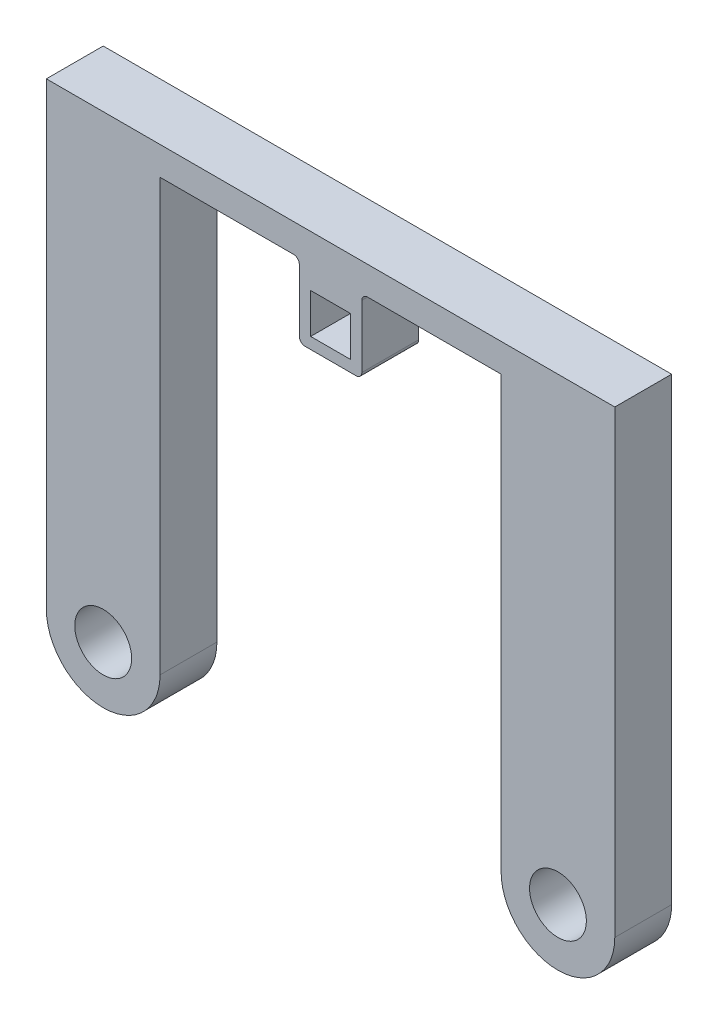
ISO-10303-21;
HEADER;
FILE_DESCRIPTION(('STEP AP214'),'2;1');
FILE_NAME('part.step','',(''),(''),'','','');
FILE_SCHEMA(('AUTOMOTIVE_DESIGN { 1 0 10303 214 1 1 1 1 }'));
ENDSEC;
DATA;
#1=APPLICATION_CONTEXT('core data for automotive mechanical design processes');
#2=APPLICATION_PROTOCOL_DEFINITION('international standard','automotive_design',2000,#1);
#3=PRODUCT_CONTEXT('',#1,'mechanical');
#4=PRODUCT('Part','Part','',(#3));
#5=PRODUCT_RELATED_PRODUCT_CATEGORY('part','',(#4));
#6=PRODUCT_DEFINITION_FORMATION('','',#4);
#7=PRODUCT_DEFINITION_CONTEXT('part definition',#1,'design');
#8=PRODUCT_DEFINITION('design','',#6,#7);
#9=PRODUCT_DEFINITION_SHAPE('','',#8);
#10=(LENGTH_UNIT() NAMED_UNIT(*) SI_UNIT(.MILLI.,.METRE.));
#11=(NAMED_UNIT(*) PLANE_ANGLE_UNIT() SI_UNIT($,.RADIAN.));
#12=(NAMED_UNIT(*) SI_UNIT($,.STERADIAN.) SOLID_ANGLE_UNIT());
#13=UNCERTAINTY_MEASURE_WITH_UNIT(LENGTH_MEASURE(1.E-05),#10,'distance_accuracy_value','');
#14=(GEOMETRIC_REPRESENTATION_CONTEXT(3) GLOBAL_UNCERTAINTY_ASSIGNED_CONTEXT((#13)) GLOBAL_UNIT_ASSIGNED_CONTEXT((#10,
#11,#12)) REPRESENTATION_CONTEXT('',''));
#15=CARTESIAN_POINT('',(0.,0.,0.));
#16=DIRECTION('',(0.,0.,1.));
#17=DIRECTION('',(1.,0.,0.));
#18=AXIS2_PLACEMENT_3D('',#15,#16,#17);
#19=CARTESIAN_POINT('',(0.,75.8172307653194,5.));
#20=DIRECTION('',(0.,1.,0.));
#21=DIRECTION('',(0.,0.,1.));
#22=AXIS2_PLACEMENT_3D('',#19,#20,#21);
#23=PLANE('',#22);
#24=DIRECTION('',(1.,0.,0.));
#25=VECTOR('',#24,1.);
#26=CARTESIAN_POINT('',(0.,75.8172307653194,-5.));
#27=LINE('',#26,#25);
#28=CARTESIAN_POINT('',(-30.,75.8172307653194,-5.));
#29=VERTEX_POINT('',#28);
#30=CARTESIAN_POINT('',(-6.5,75.8172307653194,-5.));
#31=VERTEX_POINT('',#30);
#32=EDGE_CURVE('E269',#29,#31,#27,.T.);
#33=ORIENTED_EDGE('',*,*,#32,.T.);
#34=DIRECTION('',(0.,0.,1.));
#35=VECTOR('',#34,1.);
#36=CARTESIAN_POINT('',(-6.5,75.8172307653194,5.));
#37=LINE('',#36,#35);
#38=CARTESIAN_POINT('',(-6.5,75.8172307653194,5.));
#39=VERTEX_POINT('',#38);
#40=EDGE_CURVE('E305',#31,#39,#37,.T.);
#41=ORIENTED_EDGE('',*,*,#40,.T.);
#42=DIRECTION('',(1.,0.,0.));
#43=VECTOR('',#42,1.);
#44=CARTESIAN_POINT('',(0.,75.8172307653194,5.));
#45=LINE('',#44,#43);
#46=CARTESIAN_POINT('',(-30.,75.8172307653194,5.));
#47=VERTEX_POINT('',#46);
#48=EDGE_CURVE('E237',#47,#39,#45,.T.);
#49=ORIENTED_EDGE('',*,*,#48,.F.);
#50=DIRECTION('',(0.,0.,-1.));
#51=VECTOR('',#50,1.);
#52=CARTESIAN_POINT('',(-30.,75.8172307653194,5.));
#53=LINE('',#52,#51);
#54=EDGE_CURVE('E299',#47,#29,#53,.T.);
#55=ORIENTED_EDGE('',*,*,#54,.T.);
#56=EDGE_LOOP('',(#33,#41,#49,#55));
#57=FACE_BOUND('',#56,.T.);
#58=ADVANCED_FACE('F43',(#57),#23,.F.);
#59=CARTESIAN_POINT('',(-50.,0.,5.));
#60=DIRECTION('',(-1.,0.,0.));
#61=DIRECTION('',(0.,0.,1.));
#62=AXIS2_PLACEMENT_3D('',#59,#60,#61);
#63=PLANE('',#62);
#64=DIRECTION('',(0.,1.,0.));
#65=VECTOR('',#64,1.);
#66=CARTESIAN_POINT('',(-50.,0.,-5.));
#67=LINE('',#66,#65);
#68=CARTESIAN_POINT('',(-50.,0.,-5.));
#69=VERTEX_POINT('',#68);
#70=CARTESIAN_POINT('',(-50.,80.8172307653194,-5.));
#71=VERTEX_POINT('',#70);
#72=EDGE_CURVE('E259',#69,#71,#67,.T.);
#73=ORIENTED_EDGE('',*,*,#72,.F.);
#74=DIRECTION('',(0.,0.,-1.));
#75=VECTOR('',#74,1.);
#76=CARTESIAN_POINT('',(-50.,0.,5.));
#77=LINE('',#76,#75);
#78=CARTESIAN_POINT('',(-50.,0.,5.));
#79=VERTEX_POINT('',#78);
#80=EDGE_CURVE('E303',#79,#69,#77,.T.);
#81=ORIENTED_EDGE('',*,*,#80,.F.);
#82=DIRECTION('',(0.,1.,0.));
#83=VECTOR('',#82,1.);
#84=CARTESIAN_POINT('',(-50.,0.,5.));
#85=LINE('',#84,#83);
#86=CARTESIAN_POINT('',(-50.,80.8172307653194,5.));
#87=VERTEX_POINT('',#86);
#88=EDGE_CURVE('E227',#79,#87,#85,.T.);
#89=ORIENTED_EDGE('',*,*,#88,.T.);
#90=DIRECTION('',(0.,0.,-1.));
#91=VECTOR('',#90,1.);
#92=CARTESIAN_POINT('',(-50.,80.8172307653194,5.));
#93=LINE('',#92,#91);
#94=EDGE_CURVE('E258',#87,#71,#93,.T.);
#95=ORIENTED_EDGE('',*,*,#94,.T.);
#96=EDGE_LOOP('',(#73,#81,#89,#95));
#97=FACE_BOUND('',#96,.T.);
#98=ADVANCED_FACE('F385',(#97),#63,.T.);
#99=CARTESIAN_POINT('',(-40.,0.,5.));
#100=DIRECTION('',(0.,0.,-1.));
#101=DIRECTION('',(-1.,0.,0.));
#102=AXIS2_PLACEMENT_3D('',#99,#100,#101);
#103=CYLINDRICAL_SURFACE('',#102,10.);
#104=CARTESIAN_POINT('',(-40.,0.,-5.));
#105=DIRECTION('',(0.,0.,1.));
#106=DIRECTION('',(1.,0.,0.));
#107=AXIS2_PLACEMENT_3D('',#104,#105,#106);
#108=CIRCLE('',#107,10.);
#109=CARTESIAN_POINT('',(-30.,0.,-5.));
#110=VERTEX_POINT('',#109);
#111=EDGE_CURVE('E262',#69,#110,#108,.T.);
#112=ORIENTED_EDGE('',*,*,#111,.T.);
#113=DIRECTION('',(0.,0.,-1.));
#114=VECTOR('',#113,1.);
#115=CARTESIAN_POINT('',(-30.,0.,5.));
#116=LINE('',#115,#114);
#117=CARTESIAN_POINT('',(-30.,0.,5.));
#118=VERTEX_POINT('',#117);
#119=EDGE_CURVE('E301',#118,#110,#116,.T.);
#120=ORIENTED_EDGE('',*,*,#119,.F.);
#121=CARTESIAN_POINT('',(-40.,0.,5.));
#122=DIRECTION('',(0.,0.,1.));
#123=DIRECTION('',(1.,0.,0.));
#124=AXIS2_PLACEMENT_3D('',#121,#122,#123);
#125=CIRCLE('',#124,10.);
#126=EDGE_CURVE('E230',#79,#118,#125,.T.);
#127=ORIENTED_EDGE('',*,*,#126,.F.);
#128=ORIENTED_EDGE('',*,*,#80,.T.);
#129=EDGE_LOOP('',(#112,#120,#127,#128));
#130=FACE_BOUND('',#129,.T.);
#131=ADVANCED_FACE('F402',(#130),#103,.T.);
#132=CARTESIAN_POINT('',(-30.,0.,5.));
#133=DIRECTION('',(1.,0.,0.));
#134=DIRECTION('',(0.,0.,-1.));
#135=AXIS2_PLACEMENT_3D('',#132,#133,#134);
#136=PLANE('',#135);
#137=DIRECTION('',(0.,-1.,0.));
#138=VECTOR('',#137,1.);
#139=CARTESIAN_POINT('',(-30.,0.,-5.));
#140=LINE('',#139,#138);
#141=EDGE_CURVE('E265',#29,#110,#140,.T.);
#142=ORIENTED_EDGE('',*,*,#141,.F.);
#143=ORIENTED_EDGE('',*,*,#54,.F.);
#144=DIRECTION('',(0.,-1.,0.));
#145=VECTOR('',#144,1.);
#146=CARTESIAN_POINT('',(-30.,0.,5.));
#147=LINE('',#146,#145);
#148=EDGE_CURVE('E233',#47,#118,#147,.T.);
#149=ORIENTED_EDGE('',*,*,#148,.T.);
#150=ORIENTED_EDGE('',*,*,#119,.T.);
#151=EDGE_LOOP('',(#142,#143,#149,#150));
#152=FACE_BOUND('',#151,.T.);
#153=ADVANCED_FACE('F378',(#152),#136,.T.);
#154=CARTESIAN_POINT('',(6.50000000000001,75.8172307653194,5.));
#155=VERTEX_POINT('',#154);
#156=CARTESIAN_POINT('',(30.,75.8172307653194,5.));
#157=VERTEX_POINT('',#156);
#158=EDGE_CURVE('E236',#155,#157,#45,.T.);
#159=ORIENTED_EDGE('',*,*,#158,.F.);
#160=DIRECTION('',(0.,0.,1.));
#161=VECTOR('',#160,1.);
#162=CARTESIAN_POINT('',(6.50000000000001,75.8172307653194,5.));
#163=LINE('',#162,#161);
#164=CARTESIAN_POINT('',(6.50000000000001,75.8172307653194,-5.));
#165=VERTEX_POINT('',#164);
#166=EDGE_CURVE('E318',#155,#165,#163,.F.);
#167=ORIENTED_EDGE('',*,*,#166,.T.);
#168=CARTESIAN_POINT('',(30.,75.8172307653194,-5.));
#169=VERTEX_POINT('',#168);
#170=EDGE_CURVE('E268',#165,#169,#27,.T.);
#171=ORIENTED_EDGE('',*,*,#170,.T.);
#172=DIRECTION('',(0.,0.,-1.));
#173=VECTOR('',#172,1.);
#174=CARTESIAN_POINT('',(30.,75.8172307653194,5.));
#175=LINE('',#174,#173);
#176=EDGE_CURVE('E296',#157,#169,#175,.T.);
#177=ORIENTED_EDGE('',*,*,#176,.F.);
#178=EDGE_LOOP('',(#159,#167,#171,#177));
#179=FACE_BOUND('',#178,.T.);
#180=ADVANCED_FACE('F345',(#179),#23,.F.);
#181=CARTESIAN_POINT('',(30.,0.,5.));
#182=DIRECTION('',(-1.,0.,0.));
#183=DIRECTION('',(0.,0.,1.));
#184=AXIS2_PLACEMENT_3D('',#181,#182,#183);
#185=PLANE('',#184);
#186=DIRECTION('',(0.,1.,0.));
#187=VECTOR('',#186,1.);
#188=CARTESIAN_POINT('',(30.,0.,-5.));
#189=LINE('',#188,#187);
#190=CARTESIAN_POINT('',(30.,0.,-5.));
#191=VERTEX_POINT('',#190);
#192=EDGE_CURVE('E272',#191,#169,#189,.T.);
#193=ORIENTED_EDGE('',*,*,#192,.F.);
#194=DIRECTION('',(0.,0.,-1.));
#195=VECTOR('',#194,1.);
#196=CARTESIAN_POINT('',(30.,0.,5.));
#197=LINE('',#196,#195);
#198=CARTESIAN_POINT('',(30.,0.,5.));
#199=VERTEX_POINT('',#198);
#200=EDGE_CURVE('E294',#199,#191,#197,.T.);
#201=ORIENTED_EDGE('',*,*,#200,.F.);
#202=DIRECTION('',(0.,1.,0.));
#203=VECTOR('',#202,1.);
#204=CARTESIAN_POINT('',(30.,0.,5.));
#205=LINE('',#204,#203);
#206=EDGE_CURVE('E240',#199,#157,#205,.T.);
#207=ORIENTED_EDGE('',*,*,#206,.T.);
#208=ORIENTED_EDGE('',*,*,#176,.T.);
#209=EDGE_LOOP('',(#193,#201,#207,#208));
#210=FACE_BOUND('',#209,.T.);
#211=ADVANCED_FACE('F401',(#210),#185,.T.);
#212=CARTESIAN_POINT('',(40.,0.,5.));
#213=DIRECTION('',(0.,0.,-1.));
#214=DIRECTION('',(-1.,0.,0.));
#215=AXIS2_PLACEMENT_3D('',#212,#213,#214);
#216=CYLINDRICAL_SURFACE('',#215,10.);
#217=CARTESIAN_POINT('',(40.,0.,-5.));
#218=DIRECTION('',(0.,0.,1.));
#219=DIRECTION('',(1.,0.,0.));
#220=AXIS2_PLACEMENT_3D('',#217,#218,#219);
#221=CIRCLE('',#220,10.);
#222=CARTESIAN_POINT('',(50.,0.,-5.));
#223=VERTEX_POINT('',#222);
#224=EDGE_CURVE('E275',#223,#191,#221,.F.);
#225=ORIENTED_EDGE('',*,*,#224,.F.);
#226=DIRECTION('',(0.,0.,-1.));
#227=VECTOR('',#226,1.);
#228=CARTESIAN_POINT('',(50.,0.,5.));
#229=LINE('',#228,#227);
#230=CARTESIAN_POINT('',(50.,0.,5.));
#231=VERTEX_POINT('',#230);
#232=EDGE_CURVE('E292',#231,#223,#229,.T.);
#233=ORIENTED_EDGE('',*,*,#232,.F.);
#234=CARTESIAN_POINT('',(40.,0.,5.));
#235=DIRECTION('',(0.,0.,1.));
#236=DIRECTION('',(1.,0.,0.));
#237=AXIS2_PLACEMENT_3D('',#234,#235,#236);
#238=CIRCLE('',#237,10.);
#239=EDGE_CURVE('E243',#231,#199,#238,.F.);
#240=ORIENTED_EDGE('',*,*,#239,.T.);
#241=ORIENTED_EDGE('',*,*,#200,.T.);
#242=EDGE_LOOP('',(#225,#233,#240,#241));
#243=FACE_BOUND('',#242,.T.);
#244=ADVANCED_FACE('F398',(#243),#216,.T.);
#245=CARTESIAN_POINT('',(50.,0.,5.));
#246=DIRECTION('',(1.,0.,0.));
#247=DIRECTION('',(0.,0.,-1.));
#248=AXIS2_PLACEMENT_3D('',#245,#246,#247);
#249=PLANE('',#248);
#250=DIRECTION('',(0.,-1.,0.));
#251=VECTOR('',#250,1.);
#252=CARTESIAN_POINT('',(50.,0.,-5.));
#253=LINE('',#252,#251);
#254=CARTESIAN_POINT('',(50.,80.8172307653194,-5.));
#255=VERTEX_POINT('',#254);
#256=EDGE_CURVE('E278',#255,#223,#253,.T.);
#257=ORIENTED_EDGE('',*,*,#256,.F.);
#258=DIRECTION('',(0.,0.,-1.));
#259=VECTOR('',#258,1.);
#260=CARTESIAN_POINT('',(50.,80.8172307653194,5.));
#261=LINE('',#260,#259);
#262=CARTESIAN_POINT('',(50.,80.8172307653194,5.));
#263=VERTEX_POINT('',#262);
#264=EDGE_CURVE('E290',#263,#255,#261,.T.);
#265=ORIENTED_EDGE('',*,*,#264,.F.);
#266=DIRECTION('',(0.,-1.,0.));
#267=VECTOR('',#266,1.);
#268=CARTESIAN_POINT('',(50.,0.,5.));
#269=LINE('',#268,#267);
#270=EDGE_CURVE('E246',#263,#231,#269,.T.);
#271=ORIENTED_EDGE('',*,*,#270,.T.);
#272=ORIENTED_EDGE('',*,*,#232,.T.);
#273=EDGE_LOOP('',(#257,#265,#271,#272));
#274=FACE_BOUND('',#273,.T.);
#275=ADVANCED_FACE('F394',(#274),#249,.T.);
#276=CARTESIAN_POINT('',(-40.,0.,5.));
#277=DIRECTION('',(0.,0.,-1.));
#278=DIRECTION('',(-1.,0.,0.));
#279=AXIS2_PLACEMENT_3D('',#276,#277,#278);
#280=CYLINDRICAL_SURFACE('',#279,5.);
#281=CARTESIAN_POINT('',(-40.,0.,5.));
#282=DIRECTION('',(0.,0.,1.));
#283=DIRECTION('',(1.,0.,0.));
#284=AXIS2_PLACEMENT_3D('',#281,#282,#283);
#285=CIRCLE('',#284,5.);
#286=CARTESIAN_POINT('',(-35.,0.,5.));
#287=VERTEX_POINT('',#286);
#288=EDGE_CURVE('E252',#287,#287,#285,.T.);
#289=ORIENTED_EDGE('',*,*,#288,.T.);
#290=EDGE_LOOP('',(#289));
#291=FACE_BOUND('',#290,.T.);
#292=CARTESIAN_POINT('',(-40.,0.,-5.));
#293=DIRECTION('',(0.,0.,1.));
#294=DIRECTION('',(1.,0.,0.));
#295=AXIS2_PLACEMENT_3D('',#292,#293,#294);
#296=CIRCLE('',#295,5.);
#297=CARTESIAN_POINT('',(-35.,0.,-5.));
#298=VERTEX_POINT('',#297);
#299=EDGE_CURVE('E284',#298,#298,#296,.T.);
#300=ORIENTED_EDGE('',*,*,#299,.F.);
#301=EDGE_LOOP('',(#300));
#302=FACE_BOUND('',#301,.T.);
#303=ADVANCED_FACE('F427',(#291,#302),#280,.F.);
#304=CARTESIAN_POINT('',(0.,80.8172307653194,5.));
#305=DIRECTION('',(0.,1.,0.));
#306=DIRECTION('',(0.,0.,1.));
#307=AXIS2_PLACEMENT_3D('',#304,#305,#306);
#308=PLANE('',#307);
#309=DIRECTION('',(1.,0.,0.));
#310=VECTOR('',#309,1.);
#311=CARTESIAN_POINT('',(0.,80.8172307653194,-5.));
#312=LINE('',#311,#310);
#313=EDGE_CURVE('E281',#71,#255,#312,.T.);
#314=ORIENTED_EDGE('',*,*,#313,.F.);
#315=ORIENTED_EDGE('',*,*,#94,.F.);
#316=DIRECTION('',(1.,0.,0.));
#317=VECTOR('',#316,1.);
#318=CARTESIAN_POINT('',(0.,80.8172307653194,5.));
#319=LINE('',#318,#317);
#320=EDGE_CURVE('E249',#87,#263,#319,.T.);
#321=ORIENTED_EDGE('',*,*,#320,.T.);
#322=ORIENTED_EDGE('',*,*,#264,.T.);
#323=EDGE_LOOP('',(#314,#315,#321,#322));
#324=FACE_BOUND('',#323,.T.);
#325=ADVANCED_FACE('F390',(#324),#308,.T.);
#326=CARTESIAN_POINT('',(40.,0.,5.));
#327=DIRECTION('',(0.,0.,-1.));
#328=DIRECTION('',(-1.,0.,0.));
#329=AXIS2_PLACEMENT_3D('',#326,#327,#328);
#330=CYLINDRICAL_SURFACE('',#329,5.);
#331=CARTESIAN_POINT('',(40.,0.,5.));
#332=DIRECTION('',(0.,0.,1.));
#333=DIRECTION('',(1.,0.,0.));
#334=AXIS2_PLACEMENT_3D('',#331,#332,#333);
#335=CIRCLE('',#334,5.);
#336=CARTESIAN_POINT('',(45.,0.,5.));
#337=VERTEX_POINT('',#336);
#338=EDGE_CURVE('E255',#337,#337,#335,.F.);
#339=ORIENTED_EDGE('',*,*,#338,.F.);
#340=EDGE_LOOP('',(#339));
#341=FACE_BOUND('',#340,.T.);
#342=CARTESIAN_POINT('',(40.,0.,-5.));
#343=DIRECTION('',(0.,0.,1.));
#344=DIRECTION('',(1.,0.,0.));
#345=AXIS2_PLACEMENT_3D('',#342,#343,#344);
#346=CIRCLE('',#345,5.);
#347=CARTESIAN_POINT('',(45.,0.,-5.));
#348=VERTEX_POINT('',#347);
#349=EDGE_CURVE('E231',#348,#348,#346,.F.);
#350=ORIENTED_EDGE('',*,*,#349,.T.);
#351=EDGE_LOOP('',(#350));
#352=FACE_BOUND('',#351,.T.);
#353=ADVANCED_FACE('F430',(#341,#352),#330,.F.);
#354=CARTESIAN_POINT('',(0.,0.,5.));
#355=DIRECTION('',(0.,0.,1.));
#356=DIRECTION('',(1.,0.,0.));
#357=AXIS2_PLACEMENT_3D('',#354,#355,#356);
#358=PLANE('',#357);
#359=DIRECTION('',(1.,0.,0.));
#360=VECTOR('',#359,1.);
#361=CARTESIAN_POINT('',(0.,62.8172307653194,5.));
#362=LINE('',#361,#360);
#363=CARTESIAN_POINT('',(-4.5,62.8172307653194,5.));
#364=VERTEX_POINT('',#363);
#365=CARTESIAN_POINT('',(4.50000000000001,62.8172307653194,5.));
#366=VERTEX_POINT('',#365);
#367=EDGE_CURVE('E213',#364,#366,#362,.T.);
#368=ORIENTED_EDGE('',*,*,#367,.T.);
#369=CARTESIAN_POINT('',(4.50000000000001,63.8172307653194,5.));
#370=DIRECTION('',(0.,0.,1.));
#371=DIRECTION('',(1.,0.,0.));
#372=AXIS2_PLACEMENT_3D('',#369,#370,#371);
#373=CIRCLE('',#372,1.);
#374=CARTESIAN_POINT('',(5.50000000000001,63.8172307653194,5.));
#375=VERTEX_POINT('',#374);
#376=EDGE_CURVE('E58',#366,#375,#373,.T.);
#377=ORIENTED_EDGE('',*,*,#376,.T.);
#378=DIRECTION('',(0.,1.,0.));
#379=VECTOR('',#378,1.);
#380=CARTESIAN_POINT('',(5.50000000000001,0.,5.));
#381=LINE('',#380,#379);
#382=CARTESIAN_POINT('',(5.50000000000001,74.8172307653194,5.));
#383=VERTEX_POINT('',#382);
#384=EDGE_CURVE('E340',#375,#383,#381,.T.);
#385=ORIENTED_EDGE('',*,*,#384,.T.);
#386=CARTESIAN_POINT('',(6.50000000000001,74.8172307653194,5.));
#387=DIRECTION('',(0.,0.,1.));
#388=DIRECTION('',(1.,0.,0.));
#389=AXIS2_PLACEMENT_3D('',#386,#387,#388);
#390=CIRCLE('',#389,1.);
#391=EDGE_CURVE('E51',#383,#155,#390,.F.);
#392=ORIENTED_EDGE('',*,*,#391,.T.);
#393=ORIENTED_EDGE('',*,*,#158,.T.);
#394=ORIENTED_EDGE('',*,*,#206,.F.);
#395=ORIENTED_EDGE('',*,*,#239,.F.);
#396=ORIENTED_EDGE('',*,*,#270,.F.);
#397=ORIENTED_EDGE('',*,*,#320,.F.);
#398=ORIENTED_EDGE('',*,*,#88,.F.);
#399=ORIENTED_EDGE('',*,*,#126,.T.);
#400=ORIENTED_EDGE('',*,*,#148,.F.);
#401=ORIENTED_EDGE('',*,*,#48,.T.);
#402=CARTESIAN_POINT('',(-6.5,74.8172307653194,5.));
#403=DIRECTION('',(0.,0.,1.));
#404=DIRECTION('',(1.,0.,0.));
#405=AXIS2_PLACEMENT_3D('',#402,#403,#404);
#406=CIRCLE('',#405,1.);
#407=CARTESIAN_POINT('',(-5.5,74.8172307653194,5.));
#408=VERTEX_POINT('',#407);
#409=EDGE_CURVE('E330',#39,#408,#406,.F.);
#410=ORIENTED_EDGE('',*,*,#409,.T.);
#411=DIRECTION('',(0.,1.,0.));
#412=VECTOR('',#411,1.);
#413=CARTESIAN_POINT('',(-5.5,0.,5.));
#414=LINE('',#413,#412);
#415=CARTESIAN_POINT('',(-5.5,63.8172307653194,5.));
#416=VERTEX_POINT('',#415);
#417=EDGE_CURVE('E214',#416,#408,#414,.T.);
#418=ORIENTED_EDGE('',*,*,#417,.F.);
#419=CARTESIAN_POINT('',(-4.5,63.8172307653194,5.));
#420=DIRECTION('',(0.,0.,1.));
#421=DIRECTION('',(1.,0.,0.));
#422=AXIS2_PLACEMENT_3D('',#419,#420,#421);
#423=CIRCLE('',#422,1.);
#424=EDGE_CURVE('E66',#416,#364,#423,.T.);
#425=ORIENTED_EDGE('',*,*,#424,.T.);
#426=EDGE_LOOP('',(#368,#377,#385,#392,#393,#394,#395,#396,#397,#398,#399,#400,#401,#410,#418,#425));
#427=FACE_BOUND('',#426,.T.);
#428=ORIENTED_EDGE('',*,*,#288,.F.);
#429=EDGE_LOOP('',(#428));
#430=FACE_BOUND('',#429,.T.);
#431=ORIENTED_EDGE('',*,*,#338,.T.);
#432=EDGE_LOOP('',(#431));
#433=FACE_BOUND('',#432,.T.);
#434=DIRECTION('',(1.,0.,0.));
#435=VECTOR('',#434,1.);
#436=CARTESIAN_POINT('',(0.,71.8172307653194,5.));
#437=LINE('',#436,#435);
#438=CARTESIAN_POINT('',(-3.5,71.8172307653194,5.));
#439=VERTEX_POINT('',#438);
#440=CARTESIAN_POINT('',(3.5,71.8172307653194,5.));
#441=VERTEX_POINT('',#440);
#442=EDGE_CURVE('E689',#439,#441,#437,.T.);
#443=ORIENTED_EDGE('',*,*,#442,.T.);
#444=DIRECTION('',(0.,-1.,0.));
#445=VECTOR('',#444,1.);
#446=CARTESIAN_POINT('',(3.50000000000001,0.,5.));
#447=LINE('',#446,#445);
#448=CARTESIAN_POINT('',(3.5,64.8172307653194,5.));
#449=VERTEX_POINT('',#448);
#450=EDGE_CURVE('E220',#441,#449,#447,.T.);
#451=ORIENTED_EDGE('',*,*,#450,.T.);
#452=DIRECTION('',(1.,0.,0.));
#453=VECTOR('',#452,1.);
#454=CARTESIAN_POINT('',(0.,64.8172307653194,5.));
#455=LINE('',#454,#453);
#456=CARTESIAN_POINT('',(-3.5,64.8172307653194,5.));
#457=VERTEX_POINT('',#456);
#458=EDGE_CURVE('E205',#457,#449,#455,.T.);
#459=ORIENTED_EDGE('',*,*,#458,.F.);
#460=DIRECTION('',(0.,-1.,0.));
#461=VECTOR('',#460,1.);
#462=CARTESIAN_POINT('',(-3.49999999999999,0.,5.));
#463=LINE('',#462,#461);
#464=EDGE_CURVE('E200',#439,#457,#463,.T.);
#465=ORIENTED_EDGE('',*,*,#464,.F.);
#466=EDGE_LOOP('',(#443,#451,#459,#465));
#467=FACE_BOUND('',#466,.T.);
#468=ADVANCED_FACE('F335',(#427,#430,#433,#467),#358,.T.);
#469=CARTESIAN_POINT('',(0.,0.,-5.));
#470=DIRECTION('',(0.,0.,1.));
#471=DIRECTION('',(1.,0.,0.));
#472=AXIS2_PLACEMENT_3D('',#469,#470,#471);
#473=PLANE('',#472);
#474=DIRECTION('',(0.,-1.,0.));
#475=VECTOR('',#474,1.);
#476=CARTESIAN_POINT('',(5.50000000000001,0.,-5.));
#477=LINE('',#476,#475);
#478=CARTESIAN_POINT('',(5.50000000000001,74.8172307653194,-5.));
#479=VERTEX_POINT('',#478);
#480=CARTESIAN_POINT('',(5.50000000000001,63.8172307653194,-5.));
#481=VERTEX_POINT('',#480);
#482=EDGE_CURVE('E219',#479,#481,#477,.T.);
#483=ORIENTED_EDGE('',*,*,#482,.T.);
#484=CARTESIAN_POINT('',(4.50000000000001,63.8172307653194,-5.));
#485=DIRECTION('',(0.,0.,1.));
#486=DIRECTION('',(1.,0.,0.));
#487=AXIS2_PLACEMENT_3D('',#484,#485,#486);
#488=CIRCLE('',#487,1.);
#489=CARTESIAN_POINT('',(4.50000000000001,62.8172307653194,-5.));
#490=VERTEX_POINT('',#489);
#491=EDGE_CURVE('E328',#481,#490,#488,.F.);
#492=ORIENTED_EDGE('',*,*,#491,.T.);
#493=DIRECTION('',(-1.,0.,0.));
#494=VECTOR('',#493,1.);
#495=CARTESIAN_POINT('',(0.,62.8172307653194,-5.));
#496=LINE('',#495,#494);
#497=CARTESIAN_POINT('',(-4.5,62.8172307653194,-5.));
#498=VERTEX_POINT('',#497);
#499=EDGE_CURVE('E216',#490,#498,#496,.T.);
#500=ORIENTED_EDGE('',*,*,#499,.T.);
#501=CARTESIAN_POINT('',(-4.5,63.8172307653194,-5.));
#502=DIRECTION('',(0.,0.,1.));
#503=DIRECTION('',(1.,0.,0.));
#504=AXIS2_PLACEMENT_3D('',#501,#502,#503);
#505=CIRCLE('',#504,1.);
#506=CARTESIAN_POINT('',(-5.5,63.8172307653194,-5.));
#507=VERTEX_POINT('',#506);
#508=EDGE_CURVE('E326',#498,#507,#505,.F.);
#509=ORIENTED_EDGE('',*,*,#508,.T.);
#510=DIRECTION('',(0.,-1.,0.));
#511=VECTOR('',#510,1.);
#512=CARTESIAN_POINT('',(-5.5,0.,-5.));
#513=LINE('',#512,#511);
#514=CARTESIAN_POINT('',(-5.5,74.8172307653194,-5.));
#515=VERTEX_POINT('',#514);
#516=EDGE_CURVE('E207',#515,#507,#513,.T.);
#517=ORIENTED_EDGE('',*,*,#516,.F.);
#518=CARTESIAN_POINT('',(-6.5,74.8172307653194,-5.));
#519=DIRECTION('',(0.,0.,1.));
#520=DIRECTION('',(1.,0.,0.));
#521=AXIS2_PLACEMENT_3D('',#518,#519,#520);
#522=CIRCLE('',#521,1.);
#523=EDGE_CURVE('E332',#515,#31,#522,.T.);
#524=ORIENTED_EDGE('',*,*,#523,.T.);
#525=ORIENTED_EDGE('',*,*,#32,.F.);
#526=ORIENTED_EDGE('',*,*,#141,.T.);
#527=ORIENTED_EDGE('',*,*,#111,.F.);
#528=ORIENTED_EDGE('',*,*,#72,.T.);
#529=ORIENTED_EDGE('',*,*,#313,.T.);
#530=ORIENTED_EDGE('',*,*,#256,.T.);
#531=ORIENTED_EDGE('',*,*,#224,.T.);
#532=ORIENTED_EDGE('',*,*,#192,.T.);
#533=ORIENTED_EDGE('',*,*,#170,.F.);
#534=CARTESIAN_POINT('',(6.50000000000001,74.8172307653194,-5.));
#535=DIRECTION('',(0.,0.,1.));
#536=DIRECTION('',(1.,0.,0.));
#537=AXIS2_PLACEMENT_3D('',#534,#535,#536);
#538=CIRCLE('',#537,1.);
#539=EDGE_CURVE('E11',#165,#479,#538,.T.);
#540=ORIENTED_EDGE('',*,*,#539,.T.);
#541=EDGE_LOOP('',(#483,#492,#500,#509,#517,#524,#525,#526,#527,#528,#529,#530,#531,#532,#533,#540));
#542=FACE_BOUND('',#541,.T.);
#543=ORIENTED_EDGE('',*,*,#299,.T.);
#544=EDGE_LOOP('',(#543));
#545=FACE_BOUND('',#544,.T.);
#546=ORIENTED_EDGE('',*,*,#349,.F.);
#547=EDGE_LOOP('',(#546));
#548=FACE_BOUND('',#547,.T.);
#549=DIRECTION('',(-1.,0.,0.));
#550=VECTOR('',#549,1.);
#551=CARTESIAN_POINT('',(0.,71.8172307653194,-5.));
#552=LINE('',#551,#550);
#553=CARTESIAN_POINT('',(3.5,71.8172307653194,-5.));
#554=VERTEX_POINT('',#553);
#555=CARTESIAN_POINT('',(-3.5,71.8172307653194,-5.));
#556=VERTEX_POINT('',#555);
#557=EDGE_CURVE('E186',#554,#556,#552,.T.);
#558=ORIENTED_EDGE('',*,*,#557,.T.);
#559=DIRECTION('',(0.,1.,0.));
#560=VECTOR('',#559,1.);
#561=CARTESIAN_POINT('',(-3.49999999999999,0.,-5.));
#562=LINE('',#561,#560);
#563=CARTESIAN_POINT('',(-3.5,64.8172307653194,-5.));
#564=VERTEX_POINT('',#563);
#565=EDGE_CURVE('E180',#564,#556,#562,.T.);
#566=ORIENTED_EDGE('',*,*,#565,.F.);
#567=DIRECTION('',(-1.,0.,0.));
#568=VECTOR('',#567,1.);
#569=CARTESIAN_POINT('',(0.,64.8172307653194,-5.));
#570=LINE('',#569,#568);
#571=CARTESIAN_POINT('',(3.5,64.8172307653194,-5.));
#572=VERTEX_POINT('',#571);
#573=EDGE_CURVE('E183',#572,#564,#570,.T.);
#574=ORIENTED_EDGE('',*,*,#573,.F.);
#575=DIRECTION('',(0.,1.,0.));
#576=VECTOR('',#575,1.);
#577=CARTESIAN_POINT('',(3.50000000000001,0.,-5.));
#578=LINE('',#577,#576);
#579=EDGE_CURVE('E225',#572,#554,#578,.T.);
#580=ORIENTED_EDGE('',*,*,#579,.T.);
#581=EDGE_LOOP('',(#558,#566,#574,#580));
#582=FACE_BOUND('',#581,.T.);
#583=ADVANCED_FACE('F182',(#542,#545,#548,#582),#473,.F.);
#584=CARTESIAN_POINT('',(0.,71.8172307653194,-22.0293863659264));
#585=DIRECTION('',(0.,-1.,0.));
#586=DIRECTION('',(0.,0.,-1.));
#587=AXIS2_PLACEMENT_3D('',#584,#585,#586);
#588=PLANE('',#587);
#589=ORIENTED_EDGE('',*,*,#557,.F.);
#590=DIRECTION('',(0.,0.,1.));
#591=VECTOR('',#590,1.);
#592=CARTESIAN_POINT('',(3.5,71.8172307653194,-22.0293863659264));
#593=LINE('',#592,#591);
#594=EDGE_CURVE('E191',#554,#441,#593,.T.);
#595=ORIENTED_EDGE('',*,*,#594,.T.);
#596=ORIENTED_EDGE('',*,*,#442,.F.);
#597=DIRECTION('',(0.,0.,1.));
#598=VECTOR('',#597,1.);
#599=CARTESIAN_POINT('',(-3.5,71.8172307653194,-22.0293863659264));
#600=LINE('',#599,#598);
#601=EDGE_CURVE('E190',#556,#439,#600,.T.);
#602=ORIENTED_EDGE('',*,*,#601,.F.);
#603=EDGE_LOOP('',(#589,#595,#596,#602));
#604=FACE_BOUND('',#603,.T.);
#605=ADVANCED_FACE('F439',(#604),#588,.T.);
#606=CARTESIAN_POINT('',(-3.49999999999999,0.,-22.0293863659264));
#607=DIRECTION('',(-1.,0.,0.));
#608=DIRECTION('',(0.,-1.,0.));
#609=AXIS2_PLACEMENT_3D('',#606,#607,#608);
#610=PLANE('',#609);
#611=DIRECTION('',(0.,0.,1.));
#612=VECTOR('',#611,1.);
#613=CARTESIAN_POINT('',(-3.5,64.8172307653194,-22.0293863659264));
#614=LINE('',#613,#612);
#615=EDGE_CURVE('E196',#564,#457,#614,.T.);
#616=ORIENTED_EDGE('',*,*,#615,.F.);
#617=ORIENTED_EDGE('',*,*,#565,.T.);
#618=ORIENTED_EDGE('',*,*,#601,.T.);
#619=ORIENTED_EDGE('',*,*,#464,.T.);
#620=EDGE_LOOP('',(#616,#617,#618,#619));
#621=FACE_BOUND('',#620,.T.);
#622=ADVANCED_FACE('F203',(#621),#610,.F.);
#623=CARTESIAN_POINT('',(0.,64.8172307653194,-22.0293863659264));
#624=DIRECTION('',(0.,-1.,0.));
#625=DIRECTION('',(0.,0.,-1.));
#626=AXIS2_PLACEMENT_3D('',#623,#624,#625);
#627=PLANE('',#626);
#628=DIRECTION('',(0.,0.,1.));
#629=VECTOR('',#628,1.);
#630=CARTESIAN_POINT('',(3.5,64.8172307653194,-22.0293863659264));
#631=LINE('',#630,#629);
#632=EDGE_CURVE('E198',#572,#449,#631,.T.);
#633=ORIENTED_EDGE('',*,*,#632,.F.);
#634=ORIENTED_EDGE('',*,*,#573,.T.);
#635=ORIENTED_EDGE('',*,*,#615,.T.);
#636=ORIENTED_EDGE('',*,*,#458,.T.);
#637=EDGE_LOOP('',(#633,#634,#635,#636));
#638=FACE_BOUND('',#637,.T.);
#639=ADVANCED_FACE('F194',(#638),#627,.F.);
#640=CARTESIAN_POINT('',(0.,62.8172307653194,-22.0293863659264));
#641=DIRECTION('',(0.,-1.,0.));
#642=DIRECTION('',(0.,0.,-1.));
#643=AXIS2_PLACEMENT_3D('',#640,#641,#642);
#644=PLANE('',#643);
#645=ORIENTED_EDGE('',*,*,#499,.F.);
#646=DIRECTION('',(0.,0.,1.));
#647=VECTOR('',#646,1.);
#648=CARTESIAN_POINT('',(4.50000000000001,62.8172307653194,-22.0293863659264));
#649=LINE('',#648,#647);
#650=EDGE_CURVE('E322',#490,#366,#649,.T.);
#651=ORIENTED_EDGE('',*,*,#650,.T.);
#652=ORIENTED_EDGE('',*,*,#367,.F.);
#653=DIRECTION('',(0.,0.,1.));
#654=VECTOR('',#653,1.);
#655=CARTESIAN_POINT('',(-4.5,62.8172307653194,-5.));
#656=LINE('',#655,#654);
#657=EDGE_CURVE('E320',#364,#498,#656,.F.);
#658=ORIENTED_EDGE('',*,*,#657,.T.);
#659=EDGE_LOOP('',(#645,#651,#652,#658));
#660=FACE_BOUND('',#659,.T.);
#661=ADVANCED_FACE('F359',(#660),#644,.T.);
#662=CARTESIAN_POINT('',(-5.5,0.,-22.0293863659264));
#663=DIRECTION('',(1.,0.,0.));
#664=DIRECTION('',(0.,0.,-1.));
#665=AXIS2_PLACEMENT_3D('',#662,#663,#664);
#666=PLANE('',#665);
#667=ORIENTED_EDGE('',*,*,#417,.T.);
#668=DIRECTION('',(0.,0.,1.));
#669=VECTOR('',#668,1.);
#670=CARTESIAN_POINT('',(-5.5,74.8172307653194,-5.));
#671=LINE('',#670,#669);
#672=EDGE_CURVE('E311',#408,#515,#671,.F.);
#673=ORIENTED_EDGE('',*,*,#672,.T.);
#674=ORIENTED_EDGE('',*,*,#516,.T.);
#675=DIRECTION('',(0.,0.,1.));
#676=VECTOR('',#675,1.);
#677=CARTESIAN_POINT('',(-5.5,63.8172307653194,5.));
#678=LINE('',#677,#676);
#679=EDGE_CURVE('E308',#507,#416,#678,.T.);
#680=ORIENTED_EDGE('',*,*,#679,.T.);
#681=EDGE_LOOP('',(#667,#673,#674,#680));
#682=FACE_BOUND('',#681,.T.);
#683=ADVANCED_FACE('F367',(#682),#666,.F.);
#684=CARTESIAN_POINT('',(5.50000000000001,0.,-22.0293863659264));
#685=DIRECTION('',(1.,0.,0.));
#686=DIRECTION('',(0.,0.,-1.));
#687=AXIS2_PLACEMENT_3D('',#684,#685,#686);
#688=PLANE('',#687);
#689=ORIENTED_EDGE('',*,*,#482,.F.);
#690=DIRECTION('',(0.,0.,1.));
#691=VECTOR('',#690,1.);
#692=CARTESIAN_POINT('',(5.50000000000001,74.8172307653194,-22.0293863659264));
#693=LINE('',#692,#691);
#694=EDGE_CURVE('E315',#479,#383,#693,.T.);
#695=ORIENTED_EDGE('',*,*,#694,.T.);
#696=ORIENTED_EDGE('',*,*,#384,.F.);
#697=DIRECTION('',(0.,0.,1.));
#698=VECTOR('',#697,1.);
#699=CARTESIAN_POINT('',(5.50000000000001,63.8172307653194,-22.0293863659264));
#700=LINE('',#699,#698);
#701=EDGE_CURVE('E313',#375,#481,#700,.F.);
#702=ORIENTED_EDGE('',*,*,#701,.T.);
#703=EDGE_LOOP('',(#689,#695,#696,#702));
#704=FACE_BOUND('',#703,.T.);
#705=ADVANCED_FACE('F354',(#704),#688,.T.);
#706=CARTESIAN_POINT('',(3.50000000000001,0.,-22.0293863659264));
#707=DIRECTION('',(-1.,0.,0.));
#708=DIRECTION('',(0.,-1.,0.));
#709=AXIS2_PLACEMENT_3D('',#706,#707,#708);
#710=PLANE('',#709);
#711=ORIENTED_EDGE('',*,*,#579,.F.);
#712=ORIENTED_EDGE('',*,*,#632,.T.);
#713=ORIENTED_EDGE('',*,*,#450,.F.);
#714=ORIENTED_EDGE('',*,*,#594,.F.);
#715=EDGE_LOOP('',(#711,#712,#713,#714));
#716=FACE_BOUND('',#715,.T.);
#717=ADVANCED_FACE('F449',(#716),#710,.T.);
#718=CARTESIAN_POINT('',(-6.5,74.8172307653194,5.));
#719=DIRECTION('',(0.,0.,-1.));
#720=DIRECTION('',(-1.,0.,0.));
#721=AXIS2_PLACEMENT_3D('',#718,#719,#720);
#722=CYLINDRICAL_SURFACE('',#721,1.);
#723=ORIENTED_EDGE('',*,*,#523,.F.);
#724=ORIENTED_EDGE('',*,*,#672,.F.);
#725=ORIENTED_EDGE('',*,*,#409,.F.);
#726=ORIENTED_EDGE('',*,*,#40,.F.);
#727=EDGE_LOOP('',(#723,#724,#725,#726));
#728=FACE_BOUND('',#727,.T.);
#729=ADVANCED_FACE('F370',(#728),#722,.F.);
#730=CARTESIAN_POINT('',(6.50000000000001,74.8172307653194,-22.0293863659264));
#731=DIRECTION('',(0.,0.,1.));
#732=DIRECTION('',(1.,0.,0.));
#733=AXIS2_PLACEMENT_3D('',#730,#731,#732);
#734=CYLINDRICAL_SURFACE('',#733,1.);
#735=ORIENTED_EDGE('',*,*,#539,.F.);
#736=ORIENTED_EDGE('',*,*,#166,.F.);
#737=ORIENTED_EDGE('',*,*,#391,.F.);
#738=ORIENTED_EDGE('',*,*,#694,.F.);
#739=EDGE_LOOP('',(#735,#736,#737,#738));
#740=FACE_BOUND('',#739,.T.);
#741=ADVANCED_FACE('F348',(#740),#734,.F.);
#742=CARTESIAN_POINT('',(4.50000000000001,63.8172307653194,-22.0293863659264));
#743=DIRECTION('',(0.,0.,1.));
#744=DIRECTION('',(1.,0.,0.));
#745=AXIS2_PLACEMENT_3D('',#742,#743,#744);
#746=CYLINDRICAL_SURFACE('',#745,1.);
#747=ORIENTED_EDGE('',*,*,#491,.F.);
#748=ORIENTED_EDGE('',*,*,#701,.F.);
#749=ORIENTED_EDGE('',*,*,#376,.F.);
#750=ORIENTED_EDGE('',*,*,#650,.F.);
#751=EDGE_LOOP('',(#747,#748,#749,#750));
#752=FACE_BOUND('',#751,.T.);
#753=ADVANCED_FACE('F355',(#752),#746,.T.);
#754=CARTESIAN_POINT('',(-4.5,63.8172307653194,-22.0293863659264));
#755=DIRECTION('',(0.,0.,-1.));
#756=DIRECTION('',(-1.,0.,0.));
#757=AXIS2_PLACEMENT_3D('',#754,#755,#756);
#758=CYLINDRICAL_SURFACE('',#757,1.);
#759=ORIENTED_EDGE('',*,*,#508,.F.);
#760=ORIENTED_EDGE('',*,*,#657,.F.);
#761=ORIENTED_EDGE('',*,*,#424,.F.);
#762=ORIENTED_EDGE('',*,*,#679,.F.);
#763=EDGE_LOOP('',(#759,#760,#761,#762));
#764=FACE_BOUND('',#763,.T.);
#765=ADVANCED_FACE('F45',(#764),#758,.T.);
#766=CLOSED_SHELL('',(#58,#98,#131,#153,#180,#211,#244,#275,#303,#325,#353,#468,#583,#605,#622,
#639,#661,#683,#705,#717,#729,#741,#753,#765));
#767=MANIFOLD_SOLID_BREP('B2',#766);
#768=ADVANCED_BREP_SHAPE_REPRESENTATION('',(#18,#767),#14);
#769=SHAPE_DEFINITION_REPRESENTATION(#9,#768);
ENDSEC;
END-ISO-10303-21;
